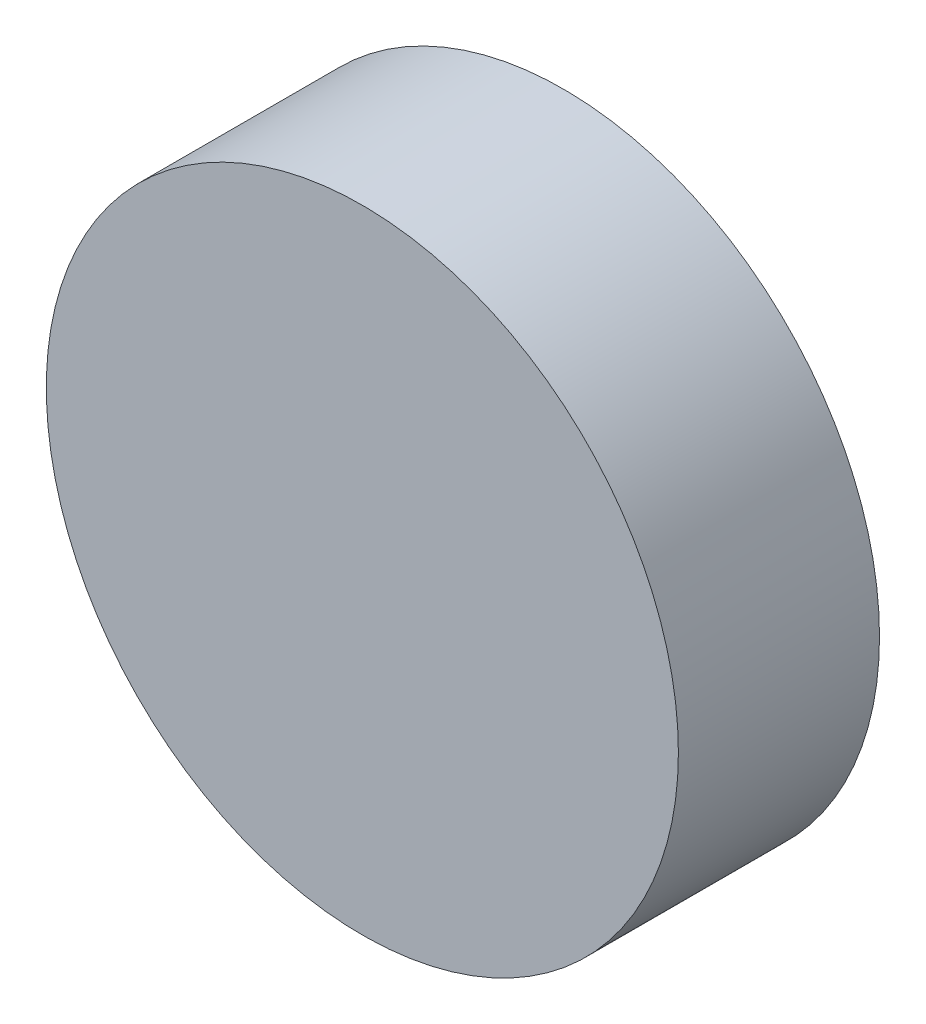
ISO-10303-21;
HEADER;
FILE_DESCRIPTION(('STEP AP214'),'2;1');
FILE_NAME('part.step','',(''),(''),'','','');
FILE_SCHEMA(('AUTOMOTIVE_DESIGN { 1 0 10303 214 1 1 1 1 }'));
ENDSEC;
DATA;
#1=APPLICATION_CONTEXT('core data for automotive mechanical design processes');
#2=APPLICATION_PROTOCOL_DEFINITION('international standard','automotive_design',2000,#1);
#3=PRODUCT_CONTEXT('',#1,'mechanical');
#4=PRODUCT('Part','Part','',(#3));
#5=PRODUCT_RELATED_PRODUCT_CATEGORY('part','',(#4));
#6=PRODUCT_DEFINITION_FORMATION('','',#4);
#7=PRODUCT_DEFINITION_CONTEXT('part definition',#1,'design');
#8=PRODUCT_DEFINITION('design','',#6,#7);
#9=PRODUCT_DEFINITION_SHAPE('','',#8);
#10=(LENGTH_UNIT() NAMED_UNIT(*) SI_UNIT(.MILLI.,.METRE.));
#11=(NAMED_UNIT(*) PLANE_ANGLE_UNIT() SI_UNIT($,.RADIAN.));
#12=(NAMED_UNIT(*) SI_UNIT($,.STERADIAN.) SOLID_ANGLE_UNIT());
#13=UNCERTAINTY_MEASURE_WITH_UNIT(LENGTH_MEASURE(1.E-05),#10,'distance_accuracy_value','');
#14=(GEOMETRIC_REPRESENTATION_CONTEXT(3) GLOBAL_UNCERTAINTY_ASSIGNED_CONTEXT((#13)) GLOBAL_UNIT_ASSIGNED_CONTEXT((#10,
#11,#12)) REPRESENTATION_CONTEXT('',''));
#15=CARTESIAN_POINT('',(0.,0.,0.));
#16=DIRECTION('',(0.,0.,1.));
#17=DIRECTION('',(1.,0.,0.));
#18=AXIS2_PLACEMENT_3D('',#15,#16,#17);
#19=CARTESIAN_POINT('',(0.,0.,7.));
#20=DIRECTION('',(0.,0.,-1.));
#21=DIRECTION('',(-1.,0.,0.));
#22=AXIS2_PLACEMENT_3D('',#19,#20,#21);
#23=CYLINDRICAL_SURFACE('',#22,11.);
#24=CARTESIAN_POINT('',(0.,0.,7.));
#25=DIRECTION('',(0.,0.,1.));
#26=DIRECTION('',(1.,0.,0.));
#27=AXIS2_PLACEMENT_3D('',#24,#25,#26);
#28=CIRCLE('',#27,11.);
#29=CARTESIAN_POINT('',(11.,0.,7.));
#30=VERTEX_POINT('',#29);
#31=EDGE_CURVE('E10',#30,#30,#28,.T.);
#32=ORIENTED_EDGE('',*,*,#31,.F.);
#33=EDGE_LOOP('',(#32));
#34=FACE_BOUND('',#33,.T.);
#35=CARTESIAN_POINT('',(0.,0.,0.));
#36=DIRECTION('',(0.,0.,1.));
#37=DIRECTION('',(1.,0.,0.));
#38=AXIS2_PLACEMENT_3D('',#35,#36,#37);
#39=CIRCLE('',#38,11.);
#40=CARTESIAN_POINT('',(11.,0.,0.));
#41=VERTEX_POINT('',#40);
#42=EDGE_CURVE('E35',#41,#41,#39,.T.);
#43=ORIENTED_EDGE('',*,*,#42,.T.);
#44=EDGE_LOOP('',(#43));
#45=FACE_BOUND('',#44,.T.);
#46=ADVANCED_FACE('F32',(#34,#45),#23,.T.);
#47=CARTESIAN_POINT('',(0.,0.,7.));
#48=DIRECTION('',(0.,0.,1.));
#49=DIRECTION('',(1.,0.,0.));
#50=AXIS2_PLACEMENT_3D('',#47,#48,#49);
#51=PLANE('',#50);
#52=ORIENTED_EDGE('',*,*,#31,.T.);
#53=EDGE_LOOP('',(#52));
#54=FACE_BOUND('',#53,.T.);
#55=ADVANCED_FACE('F61',(#54),#51,.T.);
#56=CARTESIAN_POINT('',(0.,0.,0.));
#57=DIRECTION('',(0.,0.,1.));
#58=DIRECTION('',(1.,0.,0.));
#59=AXIS2_PLACEMENT_3D('',#56,#57,#58);
#60=PLANE('',#59);
#61=CARTESIAN_POINT('',(0.,0.,0.));
#62=DIRECTION('',(0.,0.,-1.));
#63=DIRECTION('',(-1.,0.,0.));
#64=AXIS2_PLACEMENT_3D('',#61,#62,#63);
#65=CIRCLE('',#64,9.);
#66=CARTESIAN_POINT('',(-9.,0.,0.));
#67=VERTEX_POINT('',#66);
#68=EDGE_CURVE('E44',#67,#67,#65,.T.);
#69=ORIENTED_EDGE('',*,*,#68,.F.);
#70=EDGE_LOOP('',(#69));
#71=FACE_BOUND('',#70,.T.);
#72=ORIENTED_EDGE('',*,*,#42,.F.);
#73=EDGE_LOOP('',(#72));
#74=FACE_BOUND('',#73,.T.);
#75=ADVANCED_FACE('F55',(#71,#74),#60,.F.);
#76=CARTESIAN_POINT('',(0.,0.,5.));
#77=DIRECTION('',(0.,0.,-1.));
#78=DIRECTION('',(-1.,0.,0.));
#79=AXIS2_PLACEMENT_3D('',#76,#77,#78);
#80=CYLINDRICAL_SURFACE('',#79,9.);
#81=CARTESIAN_POINT('',(0.,0.,5.));
#82=DIRECTION('',(0.,0.,-1.));
#83=DIRECTION('',(-1.,0.,0.));
#84=AXIS2_PLACEMENT_3D('',#81,#82,#83);
#85=CIRCLE('',#84,9.);
#86=CARTESIAN_POINT('',(-9.,0.,5.));
#87=VERTEX_POINT('',#86);
#88=EDGE_CURVE('E42',#87,#87,#85,.T.);
#89=ORIENTED_EDGE('',*,*,#88,.F.);
#90=EDGE_LOOP('',(#89));
#91=FACE_BOUND('',#90,.T.);
#92=ORIENTED_EDGE('',*,*,#68,.T.);
#93=EDGE_LOOP('',(#92));
#94=FACE_BOUND('',#93,.T.);
#95=ADVANCED_FACE('F52',(#91,#94),#80,.F.);
#96=CARTESIAN_POINT('',(0.,0.,5.));
#97=DIRECTION('',(0.,0.,-1.));
#98=DIRECTION('',(-1.,0.,0.));
#99=AXIS2_PLACEMENT_3D('',#96,#97,#98);
#100=PLANE('',#99);
#101=ORIENTED_EDGE('',*,*,#88,.T.);
#102=EDGE_LOOP('',(#101));
#103=FACE_BOUND('',#102,.T.);
#104=ADVANCED_FACE('F50',(#103),#100,.T.);
#105=CLOSED_SHELL('',(#46,#55,#75,#95,#104));
#106=MANIFOLD_SOLID_BREP('B2',#105);
#107=ADVANCED_BREP_SHAPE_REPRESENTATION('',(#18,#106),#14);
#108=SHAPE_DEFINITION_REPRESENTATION(#9,#107);
ENDSEC;
END-ISO-10303-21;
